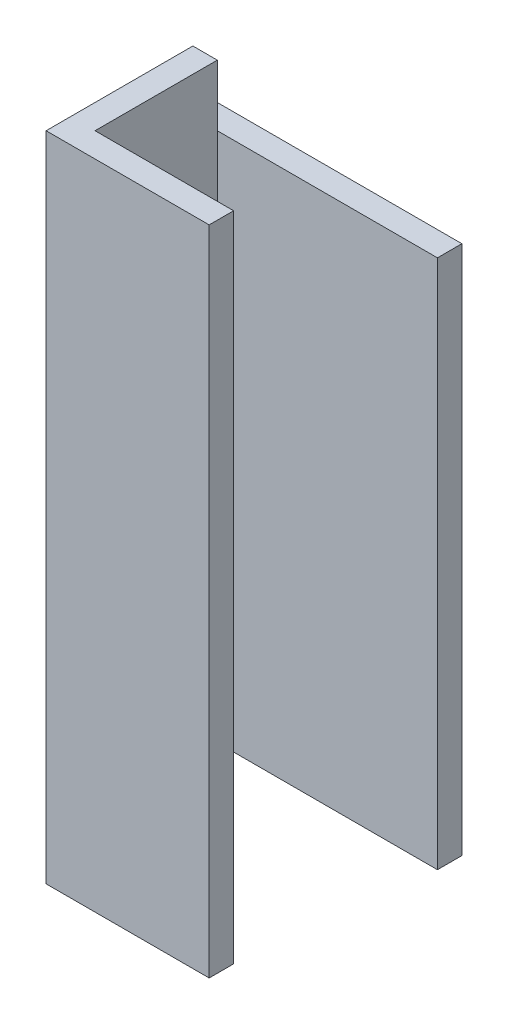
ISO-10303-21;
HEADER;
FILE_DESCRIPTION(('STEP AP214'),'2;1');
FILE_NAME('part.step','',(''),(''),'','','');
FILE_SCHEMA(('AUTOMOTIVE_DESIGN { 1 0 10303 214 1 1 1 1 }'));
ENDSEC;
DATA;
#1=APPLICATION_CONTEXT('core data for automotive mechanical design processes');
#2=APPLICATION_PROTOCOL_DEFINITION('international standard','automotive_design',2000,#1);
#3=PRODUCT_CONTEXT('',#1,'mechanical');
#4=PRODUCT('Part','Part','',(#3));
#5=PRODUCT_RELATED_PRODUCT_CATEGORY('part','',(#4));
#6=PRODUCT_DEFINITION_FORMATION('','',#4);
#7=PRODUCT_DEFINITION_CONTEXT('part definition',#1,'design');
#8=PRODUCT_DEFINITION('design','',#6,#7);
#9=PRODUCT_DEFINITION_SHAPE('','',#8);
#10=(LENGTH_UNIT() NAMED_UNIT(*) SI_UNIT(.MILLI.,.METRE.));
#11=(NAMED_UNIT(*) PLANE_ANGLE_UNIT() SI_UNIT($,.RADIAN.));
#12=(NAMED_UNIT(*) SI_UNIT($,.STERADIAN.) SOLID_ANGLE_UNIT());
#13=UNCERTAINTY_MEASURE_WITH_UNIT(LENGTH_MEASURE(1.E-05),#10,'distance_accuracy_value','');
#14=(GEOMETRIC_REPRESENTATION_CONTEXT(3) GLOBAL_UNCERTAINTY_ASSIGNED_CONTEXT((#13)) GLOBAL_UNIT_ASSIGNED_CONTEXT((#10,
#11,#12)) REPRESENTATION_CONTEXT('',''));
#15=CARTESIAN_POINT('',(0.,0.,0.));
#16=DIRECTION('',(0.,0.,1.));
#17=DIRECTION('',(1.,0.,0.));
#18=AXIS2_PLACEMENT_3D('',#15,#16,#17);
#19=CARTESIAN_POINT('',(0.3,0.4,0.105));
#20=DIRECTION('',(-1.,0.,0.));
#21=DIRECTION('',(0.,0.,1.));
#22=AXIS2_PLACEMENT_3D('',#19,#20,#21);
#23=PLANE('',#22);
#24=DIRECTION('',(0.,0.,-1.));
#25=VECTOR('',#24,1.);
#26=CARTESIAN_POINT('',(0.3,0.325,-0.075));
#27=LINE('',#26,#25);
#28=CARTESIAN_POINT('',(0.3,0.325,-0.075));
#29=VERTEX_POINT('',#28);
#30=CARTESIAN_POINT('',(0.3,0.325,-0.105));
#31=VERTEX_POINT('',#30);
#32=EDGE_CURVE('E181',#29,#31,#27,.T.);
#33=ORIENTED_EDGE('',*,*,#32,.F.);
#34=DIRECTION('',(0.,-1.,0.));
#35=VECTOR('',#34,1.);
#36=CARTESIAN_POINT('',(0.3,0.4,-0.075));
#37=LINE('',#36,#35);
#38=CARTESIAN_POINT('',(0.3,-0.325,-0.075));
#39=VERTEX_POINT('',#38);
#40=EDGE_CURVE('E152',#29,#39,#37,.T.);
#41=ORIENTED_EDGE('',*,*,#40,.T.);
#42=DIRECTION('',(0.,0.,-1.));
#43=VECTOR('',#42,1.);
#44=CARTESIAN_POINT('',(0.3,-0.325,-0.075));
#45=LINE('',#44,#43);
#46=CARTESIAN_POINT('',(0.3,-0.325,-0.105));
#47=VERTEX_POINT('',#46);
#48=EDGE_CURVE('E172',#39,#47,#45,.T.);
#49=ORIENTED_EDGE('',*,*,#48,.T.);
#50=DIRECTION('',(0.,-1.,0.));
#51=VECTOR('',#50,1.);
#52=CARTESIAN_POINT('',(0.3,0.4,-0.105));
#53=LINE('',#52,#51);
#54=EDGE_CURVE('E11',#31,#47,#53,.T.);
#55=ORIENTED_EDGE('',*,*,#54,.F.);
#56=EDGE_LOOP('',(#33,#41,#49,#55));
#57=FACE_BOUND('',#56,.T.);
#58=ADVANCED_FACE('F32',(#57),#23,.F.);
#59=CARTESIAN_POINT('',(0.,0.4,-0.105));
#60=DIRECTION('',(0.,0.,1.));
#61=DIRECTION('',(1.,0.,0.));
#62=AXIS2_PLACEMENT_3D('',#59,#60,#61);
#63=PLANE('',#62);
#64=DIRECTION('',(1.,0.,0.));
#65=VECTOR('',#64,1.);
#66=CARTESIAN_POINT('',(0.,0.325,-0.105));
#67=LINE('',#66,#65);
#68=CARTESIAN_POINT('',(0.,0.325,-0.105));
#69=VERTEX_POINT('',#68);
#70=EDGE_CURVE('E125',#69,#31,#67,.T.);
#71=ORIENTED_EDGE('',*,*,#70,.T.);
#72=ORIENTED_EDGE('',*,*,#54,.T.);
#73=DIRECTION('',(1.,0.,0.));
#74=VECTOR('',#73,1.);
#75=CARTESIAN_POINT('',(0.,-0.325,-0.105));
#76=LINE('',#75,#74);
#77=CARTESIAN_POINT('',(0.,-0.325,-0.105));
#78=VERTEX_POINT('',#77);
#79=EDGE_CURVE('E167',#78,#47,#76,.T.);
#80=ORIENTED_EDGE('',*,*,#79,.F.);
#81=DIRECTION('',(0.,-1.,0.));
#82=VECTOR('',#81,1.);
#83=CARTESIAN_POINT('',(0.,0.4,-0.105));
#84=LINE('',#83,#82);
#85=EDGE_CURVE('E39',#69,#78,#84,.T.);
#86=ORIENTED_EDGE('',*,*,#85,.F.);
#87=EDGE_LOOP('',(#71,#72,#80,#86));
#88=FACE_BOUND('',#87,.T.);
#89=ADVANCED_FACE('F175',(#88),#63,.F.);
#90=CARTESIAN_POINT('',(0.,0.4,0.105));
#91=DIRECTION('',(1.,0.,0.));
#92=DIRECTION('',(0.,0.,-1.));
#93=AXIS2_PLACEMENT_3D('',#90,#91,#92);
#94=PLANE('',#93);
#95=DIRECTION('',(0.,0.,-1.));
#96=VECTOR('',#95,1.);
#97=CARTESIAN_POINT('',(0.,0.325,-0.075));
#98=LINE('',#97,#96);
#99=CARTESIAN_POINT('',(0.,0.325,-0.075));
#100=VERTEX_POINT('',#99);
#101=EDGE_CURVE('E159',#100,#69,#98,.T.);
#102=ORIENTED_EDGE('',*,*,#101,.T.);
#103=ORIENTED_EDGE('',*,*,#85,.T.);
#104=DIRECTION('',(0.,0.,-1.));
#105=VECTOR('',#104,1.);
#106=CARTESIAN_POINT('',(0.,-0.325,-0.075));
#107=LINE('',#106,#105);
#108=CARTESIAN_POINT('',(0.,-0.325,-0.075));
#109=VERTEX_POINT('',#108);
#110=EDGE_CURVE('E158',#109,#78,#107,.T.);
#111=ORIENTED_EDGE('',*,*,#110,.F.);
#112=DIRECTION('',(0.,1.,0.));
#113=VECTOR('',#112,1.);
#114=CARTESIAN_POINT('',(0.,-0.4,-0.075));
#115=LINE('',#114,#113);
#116=CARTESIAN_POINT('',(0.,-0.4,-0.075));
#117=VERTEX_POINT('',#116);
#118=EDGE_CURVE('E177',#117,#109,#115,.T.);
#119=ORIENTED_EDGE('',*,*,#118,.F.);
#120=DIRECTION('',(0.,0.,1.));
#121=VECTOR('',#120,1.);
#122=CARTESIAN_POINT('',(0.,-0.4,0.105));
#123=LINE('',#122,#121);
#124=CARTESIAN_POINT('',(0.,-0.4,0.105));
#125=VERTEX_POINT('',#124);
#126=EDGE_CURVE('E146',#117,#125,#123,.T.);
#127=ORIENTED_EDGE('',*,*,#126,.T.);
#128=DIRECTION('',(0.,-1.,0.));
#129=VECTOR('',#128,1.);
#130=CARTESIAN_POINT('',(0.,0.4,0.105));
#131=LINE('',#130,#129);
#132=CARTESIAN_POINT('',(0.,0.4,0.105));
#133=VERTEX_POINT('',#132);
#134=EDGE_CURVE('E139',#133,#125,#131,.T.);
#135=ORIENTED_EDGE('',*,*,#134,.F.);
#136=DIRECTION('',(0.,0.,1.));
#137=VECTOR('',#136,1.);
#138=CARTESIAN_POINT('',(0.,0.4,0.105));
#139=LINE('',#138,#137);
#140=CARTESIAN_POINT('',(0.,0.4,-0.075));
#141=VERTEX_POINT('',#140);
#142=EDGE_CURVE('E131',#141,#133,#139,.T.);
#143=ORIENTED_EDGE('',*,*,#142,.F.);
#144=DIRECTION('',(0.,-1.,0.));
#145=VECTOR('',#144,1.);
#146=CARTESIAN_POINT('',(0.,0.4,-0.075));
#147=LINE('',#146,#145);
#148=EDGE_CURVE('E114',#141,#100,#147,.T.);
#149=ORIENTED_EDGE('',*,*,#148,.T.);
#150=EDGE_LOOP('',(#102,#103,#111,#119,#127,#135,#143,#149));
#151=FACE_BOUND('',#150,.T.);
#152=ADVANCED_FACE('F137',(#151),#94,.F.);
#153=CARTESIAN_POINT('',(0.,0.4,0.));
#154=DIRECTION('',(0.,-1.,0.));
#155=DIRECTION('',(0.,0.,-1.));
#156=AXIS2_PLACEMENT_3D('',#153,#154,#155);
#157=PLANE('',#156);
#158=DIRECTION('',(-1.,0.,0.));
#159=VECTOR('',#158,1.);
#160=CARTESIAN_POINT('',(0.,0.4,-0.075));
#161=LINE('',#160,#159);
#162=CARTESIAN_POINT('',(0.03,0.4,-0.075));
#163=VERTEX_POINT('',#162);
#164=EDGE_CURVE('E117',#163,#141,#161,.T.);
#165=ORIENTED_EDGE('',*,*,#164,.T.);
#166=ORIENTED_EDGE('',*,*,#142,.T.);
#167=DIRECTION('',(1.,0.,0.));
#168=VECTOR('',#167,1.);
#169=CARTESIAN_POINT('',(0.,0.4,0.105));
#170=LINE('',#169,#168);
#171=CARTESIAN_POINT('',(0.2,0.4,0.105));
#172=VERTEX_POINT('',#171);
#173=EDGE_CURVE('E141',#133,#172,#170,.T.);
#174=ORIENTED_EDGE('',*,*,#173,.T.);
#175=DIRECTION('',(0.,0.,-1.));
#176=VECTOR('',#175,1.);
#177=CARTESIAN_POINT('',(0.2,0.4,0.105));
#178=LINE('',#177,#176);
#179=CARTESIAN_POINT('',(0.2,0.4,0.075));
#180=VERTEX_POINT('',#179);
#181=EDGE_CURVE('E187',#172,#180,#178,.T.);
#182=ORIENTED_EDGE('',*,*,#181,.T.);
#183=DIRECTION('',(-1.,0.,0.));
#184=VECTOR('',#183,1.);
#185=CARTESIAN_POINT('',(0.3,0.4,0.075));
#186=LINE('',#185,#184);
#187=CARTESIAN_POINT('',(0.03,0.4,0.075));
#188=VERTEX_POINT('',#187);
#189=EDGE_CURVE('E196',#180,#188,#186,.T.);
#190=ORIENTED_EDGE('',*,*,#189,.T.);
#191=DIRECTION('',(0.,0.,-1.));
#192=VECTOR('',#191,1.);
#193=CARTESIAN_POINT('',(0.03,0.4,0.075));
#194=LINE('',#193,#192);
#195=EDGE_CURVE('E134',#188,#163,#194,.T.);
#196=ORIENTED_EDGE('',*,*,#195,.T.);
#197=EDGE_LOOP('',(#165,#166,#174,#182,#190,#196));
#198=FACE_BOUND('',#197,.T.);
#199=ADVANCED_FACE('F129',(#198),#157,.F.);
#200=CARTESIAN_POINT('',(0.3,0.4,-0.075));
#201=DIRECTION('',(0.,0.,-1.));
#202=DIRECTION('',(-1.,0.,0.));
#203=AXIS2_PLACEMENT_3D('',#200,#201,#202);
#204=PLANE('',#203);
#205=DIRECTION('',(1.,0.,0.));
#206=VECTOR('',#205,1.);
#207=CARTESIAN_POINT('',(0.,0.325,-0.075));
#208=LINE('',#207,#206);
#209=CARTESIAN_POINT('',(0.03,0.325,-0.075));
#210=VERTEX_POINT('',#209);
#211=EDGE_CURVE('E135',#210,#29,#208,.T.);
#212=ORIENTED_EDGE('',*,*,#211,.F.);
#213=DIRECTION('',(0.,-1.,0.));
#214=VECTOR('',#213,1.);
#215=CARTESIAN_POINT('',(0.03,0.4,-0.075));
#216=LINE('',#215,#214);
#217=CARTESIAN_POINT('',(0.03,-0.325,-0.075));
#218=VERTEX_POINT('',#217);
#219=EDGE_CURVE('E46',#210,#218,#216,.T.);
#220=ORIENTED_EDGE('',*,*,#219,.T.);
#221=DIRECTION('',(1.,0.,0.));
#222=VECTOR('',#221,1.);
#223=CARTESIAN_POINT('',(0.,-0.325,-0.075));
#224=LINE('',#223,#222);
#225=EDGE_CURVE('E179',#218,#39,#224,.T.);
#226=ORIENTED_EDGE('',*,*,#225,.T.);
#227=ORIENTED_EDGE('',*,*,#40,.F.);
#228=EDGE_LOOP('',(#212,#220,#226,#227));
#229=FACE_BOUND('',#228,.T.);
#230=ADVANCED_FACE('F228',(#229),#204,.F.);
#231=CARTESIAN_POINT('',(0.,-0.4,0.));
#232=DIRECTION('',(0.,-1.,0.));
#233=DIRECTION('',(0.,0.,-1.));
#234=AXIS2_PLACEMENT_3D('',#231,#232,#233);
#235=PLANE('',#234);
#236=ORIENTED_EDGE('',*,*,#126,.F.);
#237=DIRECTION('',(-1.,0.,0.));
#238=VECTOR('',#237,1.);
#239=CARTESIAN_POINT('',(0.,-0.4,-0.075));
#240=LINE('',#239,#238);
#241=CARTESIAN_POINT('',(0.03,-0.4,-0.075));
#242=VERTEX_POINT('',#241);
#243=EDGE_CURVE('E173',#242,#117,#240,.T.);
#244=ORIENTED_EDGE('',*,*,#243,.F.);
#245=DIRECTION('',(0.,0.,-1.));
#246=VECTOR('',#245,1.);
#247=CARTESIAN_POINT('',(0.03,-0.4,0.075));
#248=LINE('',#247,#246);
#249=CARTESIAN_POINT('',(0.03,-0.4,0.075));
#250=VERTEX_POINT('',#249);
#251=EDGE_CURVE('E198',#250,#242,#248,.T.);
#252=ORIENTED_EDGE('',*,*,#251,.F.);
#253=DIRECTION('',(-1.,0.,0.));
#254=VECTOR('',#253,1.);
#255=CARTESIAN_POINT('',(0.3,-0.4,0.075));
#256=LINE('',#255,#254);
#257=CARTESIAN_POINT('',(0.2,-0.4,0.075));
#258=VERTEX_POINT('',#257);
#259=EDGE_CURVE('E194',#258,#250,#256,.T.);
#260=ORIENTED_EDGE('',*,*,#259,.F.);
#261=DIRECTION('',(0.,0.,-1.));
#262=VECTOR('',#261,1.);
#263=CARTESIAN_POINT('',(0.2,-0.4,0.105));
#264=LINE('',#263,#262);
#265=CARTESIAN_POINT('',(0.2,-0.4,0.105));
#266=VERTEX_POINT('',#265);
#267=EDGE_CURVE('E54',#266,#258,#264,.T.);
#268=ORIENTED_EDGE('',*,*,#267,.F.);
#269=DIRECTION('',(1.,0.,0.));
#270=VECTOR('',#269,1.);
#271=CARTESIAN_POINT('',(0.,-0.4,0.105));
#272=LINE('',#271,#270);
#273=EDGE_CURVE('E142',#125,#266,#272,.T.);
#274=ORIENTED_EDGE('',*,*,#273,.F.);
#275=EDGE_LOOP('',(#236,#244,#252,#260,#268,#274));
#276=FACE_BOUND('',#275,.T.);
#277=ADVANCED_FACE('F218',(#276),#235,.T.);
#278=CARTESIAN_POINT('',(0.,0.4,0.105));
#279=DIRECTION('',(0.,0.,-1.));
#280=DIRECTION('',(-1.,0.,0.));
#281=AXIS2_PLACEMENT_3D('',#278,#279,#280);
#282=PLANE('',#281);
#283=ORIENTED_EDGE('',*,*,#273,.T.);
#284=DIRECTION('',(0.,-1.,0.));
#285=VECTOR('',#284,1.);
#286=CARTESIAN_POINT('',(0.2,0.4,0.105));
#287=LINE('',#286,#285);
#288=EDGE_CURVE('E190',#172,#266,#287,.T.);
#289=ORIENTED_EDGE('',*,*,#288,.F.);
#290=ORIENTED_EDGE('',*,*,#173,.F.);
#291=ORIENTED_EDGE('',*,*,#134,.T.);
#292=EDGE_LOOP('',(#283,#289,#290,#291));
#293=FACE_BOUND('',#292,.T.);
#294=ADVANCED_FACE('F235',(#293),#282,.F.);
#295=CARTESIAN_POINT('',(0.03,0.4,0.075));
#296=DIRECTION('',(-1.,0.,0.));
#297=DIRECTION('',(0.,0.,1.));
#298=AXIS2_PLACEMENT_3D('',#295,#296,#297);
#299=PLANE('',#298);
#300=ORIENTED_EDGE('',*,*,#251,.T.);
#301=EDGE_CURVE('E204',#218,#242,#216,.T.);
#302=ORIENTED_EDGE('',*,*,#301,.F.);
#303=ORIENTED_EDGE('',*,*,#219,.F.);
#304=EDGE_CURVE('E203',#163,#210,#216,.T.);
#305=ORIENTED_EDGE('',*,*,#304,.F.);
#306=ORIENTED_EDGE('',*,*,#195,.F.);
#307=DIRECTION('',(0.,-1.,0.));
#308=VECTOR('',#307,1.);
#309=CARTESIAN_POINT('',(0.03,0.4,0.075));
#310=LINE('',#309,#308);
#311=EDGE_CURVE('E149',#188,#250,#310,.T.);
#312=ORIENTED_EDGE('',*,*,#311,.T.);
#313=EDGE_LOOP('',(#300,#302,#303,#305,#306,#312));
#314=FACE_BOUND('',#313,.T.);
#315=ADVANCED_FACE('F212',(#314),#299,.F.);
#316=CARTESIAN_POINT('',(0.3,0.4,0.075));
#317=DIRECTION('',(0.,0.,1.));
#318=DIRECTION('',(1.,0.,0.));
#319=AXIS2_PLACEMENT_3D('',#316,#317,#318);
#320=PLANE('',#319);
#321=ORIENTED_EDGE('',*,*,#189,.F.);
#322=DIRECTION('',(0.,-1.,0.));
#323=VECTOR('',#322,1.);
#324=CARTESIAN_POINT('',(0.2,0.4,0.075));
#325=LINE('',#324,#323);
#326=EDGE_CURVE('E192',#180,#258,#325,.T.);
#327=ORIENTED_EDGE('',*,*,#326,.T.);
#328=ORIENTED_EDGE('',*,*,#259,.T.);
#329=ORIENTED_EDGE('',*,*,#311,.F.);
#330=EDGE_LOOP('',(#321,#327,#328,#329));
#331=FACE_BOUND('',#330,.T.);
#332=ADVANCED_FACE('F252',(#331),#320,.F.);
#333=CARTESIAN_POINT('',(0.2,0.4,0.105));
#334=DIRECTION('',(-1.,0.,0.));
#335=DIRECTION('',(0.,0.,1.));
#336=AXIS2_PLACEMENT_3D('',#333,#334,#335);
#337=PLANE('',#336);
#338=ORIENTED_EDGE('',*,*,#267,.T.);
#339=ORIENTED_EDGE('',*,*,#326,.F.);
#340=ORIENTED_EDGE('',*,*,#181,.F.);
#341=ORIENTED_EDGE('',*,*,#288,.T.);
#342=EDGE_LOOP('',(#338,#339,#340,#341));
#343=FACE_BOUND('',#342,.T.);
#344=ADVANCED_FACE('F254',(#343),#337,.F.);
#345=CARTESIAN_POINT('',(0.,0.,-0.075));
#346=DIRECTION('',(0.,0.,-1.));
#347=DIRECTION('',(-1.,0.,0.));
#348=AXIS2_PLACEMENT_3D('',#345,#346,#347);
#349=PLANE('',#348);
#350=ORIENTED_EDGE('',*,*,#301,.T.);
#351=ORIENTED_EDGE('',*,*,#243,.T.);
#352=ORIENTED_EDGE('',*,*,#118,.T.);
#353=EDGE_CURVE('E170',#109,#218,#224,.T.);
#354=ORIENTED_EDGE('',*,*,#353,.T.);
#355=EDGE_LOOP('',(#350,#351,#352,#354));
#356=FACE_BOUND('',#355,.T.);
#357=ADVANCED_FACE('F271',(#356),#349,.T.);
#358=CARTESIAN_POINT('',(0.,-0.325,-0.075));
#359=DIRECTION('',(0.,1.,0.));
#360=DIRECTION('',(0.,0.,1.));
#361=AXIS2_PLACEMENT_3D('',#358,#359,#360);
#362=PLANE('',#361);
#363=ORIENTED_EDGE('',*,*,#79,.T.);
#364=ORIENTED_EDGE('',*,*,#48,.F.);
#365=ORIENTED_EDGE('',*,*,#225,.F.);
#366=ORIENTED_EDGE('',*,*,#353,.F.);
#367=ORIENTED_EDGE('',*,*,#110,.T.);
#368=EDGE_LOOP('',(#363,#364,#365,#366,#367));
#369=FACE_BOUND('',#368,.T.);
#370=ADVANCED_FACE('F165',(#369),#362,.F.);
#371=CARTESIAN_POINT('',(0.,0.,-0.075));
#372=DIRECTION('',(0.,0.,-1.));
#373=DIRECTION('',(-1.,0.,0.));
#374=AXIS2_PLACEMENT_3D('',#371,#372,#373);
#375=PLANE('',#374);
#376=ORIENTED_EDGE('',*,*,#304,.T.);
#377=EDGE_CURVE('E120',#100,#210,#208,.T.);
#378=ORIENTED_EDGE('',*,*,#377,.F.);
#379=ORIENTED_EDGE('',*,*,#148,.F.);
#380=ORIENTED_EDGE('',*,*,#164,.F.);
#381=EDGE_LOOP('',(#376,#378,#379,#380));
#382=FACE_BOUND('',#381,.T.);
#383=ADVANCED_FACE('F116',(#382),#375,.T.);
#384=CARTESIAN_POINT('',(0.,0.325,-0.075));
#385=DIRECTION('',(0.,1.,0.));
#386=DIRECTION('',(0.,0.,1.));
#387=AXIS2_PLACEMENT_3D('',#384,#385,#386);
#388=PLANE('',#387);
#389=ORIENTED_EDGE('',*,*,#70,.F.);
#390=ORIENTED_EDGE('',*,*,#101,.F.);
#391=ORIENTED_EDGE('',*,*,#377,.T.);
#392=ORIENTED_EDGE('',*,*,#211,.T.);
#393=ORIENTED_EDGE('',*,*,#32,.T.);
#394=EDGE_LOOP('',(#389,#390,#391,#392,#393));
#395=FACE_BOUND('',#394,.T.);
#396=ADVANCED_FACE('F225',(#395),#388,.T.);
#397=CLOSED_SHELL('',(#58,#89,#152,#199,#230,#277,#294,#315,#332,#344,#357,#370,#383,#396));
#398=MANIFOLD_SOLID_BREP('B2',#397);
#399=ADVANCED_BREP_SHAPE_REPRESENTATION('',(#18,#398),#14);
#400=SHAPE_DEFINITION_REPRESENTATION(#9,#399);
ENDSEC;
END-ISO-10303-21;
